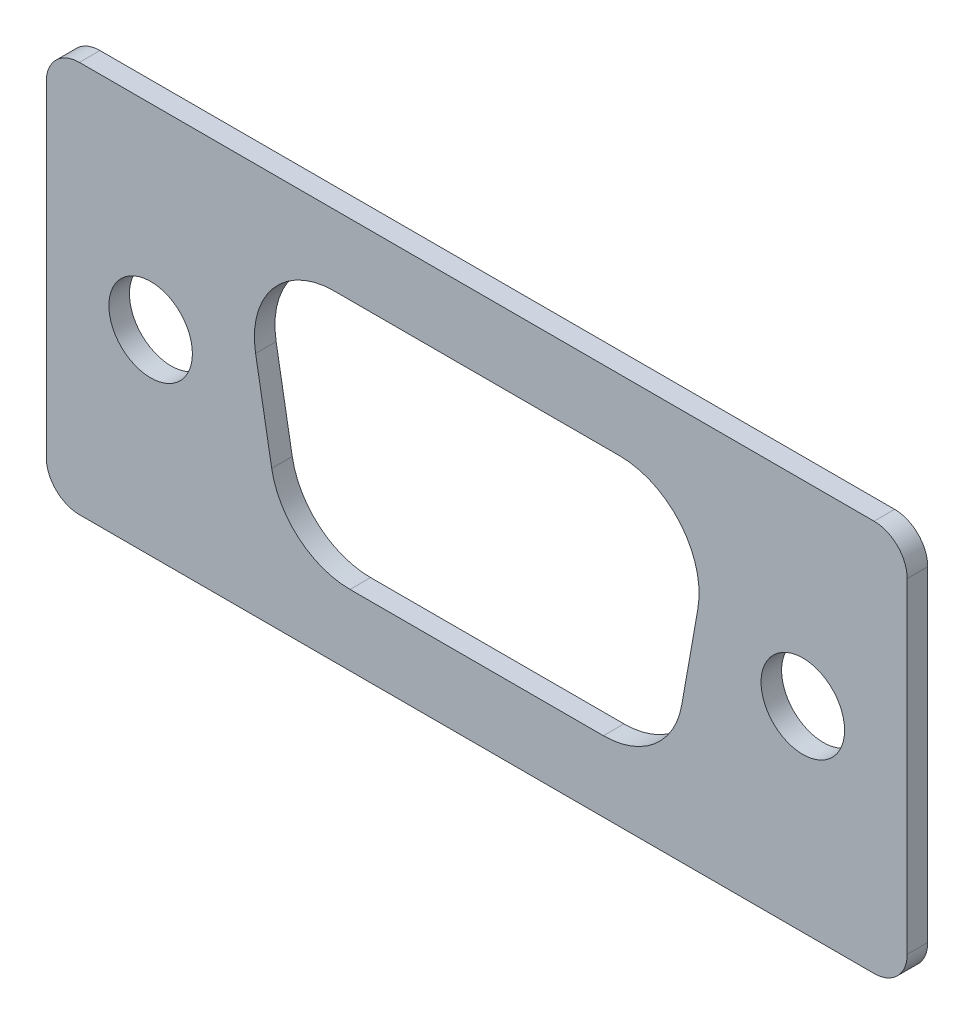
ISO-10303-21;
HEADER;
FILE_DESCRIPTION(('STEP AP214'),'2;1');
FILE_NAME('part.step','',(''),(''),'','','');
FILE_SCHEMA(('AUTOMOTIVE_DESIGN { 1 0 10303 214 1 1 1 1 }'));
ENDSEC;
DATA;
#1=APPLICATION_CONTEXT('core data for automotive mechanical design processes');
#2=APPLICATION_PROTOCOL_DEFINITION('international standard','automotive_design',2000,#1);
#3=PRODUCT_CONTEXT('',#1,'mechanical');
#4=PRODUCT('Part','Part','',(#3));
#5=PRODUCT_RELATED_PRODUCT_CATEGORY('part','',(#4));
#6=PRODUCT_DEFINITION_FORMATION('','',#4);
#7=PRODUCT_DEFINITION_CONTEXT('part definition',#1,'design');
#8=PRODUCT_DEFINITION('design','',#6,#7);
#9=PRODUCT_DEFINITION_SHAPE('','',#8);
#10=(LENGTH_UNIT() NAMED_UNIT(*) SI_UNIT(.MILLI.,.METRE.));
#11=(NAMED_UNIT(*) PLANE_ANGLE_UNIT() SI_UNIT($,.RADIAN.));
#12=(NAMED_UNIT(*) SI_UNIT($,.STERADIAN.) SOLID_ANGLE_UNIT());
#13=UNCERTAINTY_MEASURE_WITH_UNIT(LENGTH_MEASURE(1.E-05),#10,'distance_accuracy_value','');
#14=(GEOMETRIC_REPRESENTATION_CONTEXT(3) GLOBAL_UNCERTAINTY_ASSIGNED_CONTEXT((#13)) GLOBAL_UNIT_ASSIGNED_CONTEXT((#10,
#11,#12)) REPRESENTATION_CONTEXT('',''));
#15=CARTESIAN_POINT('',(0.,0.,0.));
#16=DIRECTION('',(0.,0.,1.));
#17=DIRECTION('',(1.,0.,0.));
#18=AXIS2_PLACEMENT_3D('',#15,#16,#17);
#19=CARTESIAN_POINT('',(31.72,13.74,0.7874));
#20=DIRECTION('',(0.,0.,-1.));
#21=DIRECTION('',(-1.,0.,0.));
#22=AXIS2_PLACEMENT_3D('',#19,#20,#21);
#23=PLANE('',#22);
#24=CARTESIAN_POINT('',(28.99,7.505,0.7874));
#25=DIRECTION('',(0.,0.,1.));
#26=DIRECTION('',(1.,0.,0.));
#27=AXIS2_PLACEMENT_3D('',#24,#25,#26);
#28=CIRCLE('',#27,1.6002);
#29=CARTESIAN_POINT('',(30.5902,7.505,0.7874));
#30=VERTEX_POINT('',#29);
#31=EDGE_CURVE('E219',#30,#30,#28,.T.);
#32=ORIENTED_EDGE('',*,*,#31,.F.);
#33=EDGE_LOOP('',(#32));
#34=FACE_BOUND('',#33,.T.);
#35=CARTESIAN_POINT('',(4.,7.505,0.7874));
#36=DIRECTION('',(0.,0.,1.));
#37=DIRECTION('',(1.,0.,0.));
#38=AXIS2_PLACEMENT_3D('',#35,#36,#37);
#39=CIRCLE('',#38,1.6002);
#40=CARTESIAN_POINT('',(5.6002,7.505,0.7874));
#41=VERTEX_POINT('',#40);
#42=EDGE_CURVE('E225',#41,#41,#39,.T.);
#43=ORIENTED_EDGE('',*,*,#42,.F.);
#44=EDGE_LOOP('',(#43));
#45=FACE_BOUND('',#44,.T.);
#46=CARTESIAN_POINT('',(31.72,13.74,0.7874));
#47=DIRECTION('',(0.,0.,1.));
#48=DIRECTION('',(-1.,0.,0.));
#49=AXIS2_PLACEMENT_3D('',#46,#47,#48);
#50=CIRCLE('',#49,1.27);
#51=CARTESIAN_POINT('',(32.99,13.74,0.7874));
#52=VERTEX_POINT('',#51);
#53=CARTESIAN_POINT('',(31.72,15.01,0.7874));
#54=VERTEX_POINT('',#53);
#55=EDGE_CURVE('E231',#52,#54,#50,.T.);
#56=ORIENTED_EDGE('',*,*,#55,.T.);
#57=DIRECTION('',(-1.,0.,0.));
#58=VECTOR('',#57,1.);
#59=CARTESIAN_POINT('',(1.27000000000001,15.01,0.7874));
#60=LINE('',#59,#58);
#61=CARTESIAN_POINT('',(1.27000000000001,15.01,0.7874));
#62=VERTEX_POINT('',#61);
#63=EDGE_CURVE('E234',#54,#62,#60,.T.);
#64=ORIENTED_EDGE('',*,*,#63,.T.);
#65=CARTESIAN_POINT('',(1.27,13.74,0.7874));
#66=DIRECTION('',(0.,0.,1.));
#67=DIRECTION('',(-1.,0.,0.));
#68=AXIS2_PLACEMENT_3D('',#65,#66,#67);
#69=CIRCLE('',#68,1.27);
#70=CARTESIAN_POINT('',(0.,13.74,0.7874));
#71=VERTEX_POINT('',#70);
#72=EDGE_CURVE('E237',#62,#71,#69,.T.);
#73=ORIENTED_EDGE('',*,*,#72,.T.);
#74=DIRECTION('',(0.,-1.,0.));
#75=VECTOR('',#74,1.);
#76=CARTESIAN_POINT('',(0.,1.27000000000001,0.7874));
#77=LINE('',#76,#75);
#78=CARTESIAN_POINT('',(0.,1.27000000000001,0.7874));
#79=VERTEX_POINT('',#78);
#80=EDGE_CURVE('E239',#71,#79,#77,.T.);
#81=ORIENTED_EDGE('',*,*,#80,.T.);
#82=CARTESIAN_POINT('',(1.27,1.27,0.7874));
#83=DIRECTION('',(0.,0.,1.));
#84=DIRECTION('',(-1.,0.,0.));
#85=AXIS2_PLACEMENT_3D('',#82,#83,#84);
#86=CIRCLE('',#85,1.27);
#87=CARTESIAN_POINT('',(1.27000000000001,0.,0.7874));
#88=VERTEX_POINT('',#87);
#89=EDGE_CURVE('E241',#79,#88,#86,.T.);
#90=ORIENTED_EDGE('',*,*,#89,.T.);
#91=DIRECTION('',(1.,0.,0.));
#92=VECTOR('',#91,1.);
#93=CARTESIAN_POINT('',(1.27000000000001,0.,0.7874));
#94=LINE('',#93,#92);
#95=CARTESIAN_POINT('',(31.72,0.,0.7874));
#96=VERTEX_POINT('',#95);
#97=EDGE_CURVE('E243',#88,#96,#94,.T.);
#98=ORIENTED_EDGE('',*,*,#97,.T.);
#99=CARTESIAN_POINT('',(31.72,1.27,0.7874));
#100=DIRECTION('',(0.,0.,1.));
#101=DIRECTION('',(1.,0.,0.));
#102=AXIS2_PLACEMENT_3D('',#99,#100,#101);
#103=CIRCLE('',#102,1.27);
#104=CARTESIAN_POINT('',(32.99,1.27,0.7874));
#105=VERTEX_POINT('',#104);
#106=EDGE_CURVE('E245',#96,#105,#103,.T.);
#107=ORIENTED_EDGE('',*,*,#106,.T.);
#108=DIRECTION('',(0.,1.,0.));
#109=VECTOR('',#108,1.);
#110=CARTESIAN_POINT('',(32.99,1.27000000000001,0.7874));
#111=LINE('',#110,#109);
#112=EDGE_CURVE('E247',#105,#52,#111,.T.);
#113=ORIENTED_EDGE('',*,*,#112,.T.);
#114=EDGE_LOOP('',(#56,#64,#73,#81,#90,#98,#107,#113));
#115=FACE_BOUND('',#114,.T.);
#116=CARTESIAN_POINT('',(11.6403146906296,5.753,0.7874));
#117=DIRECTION('',(0.,0.,1.));
#118=DIRECTION('',(-1.,0.,0.));
#119=AXIS2_PLACEMENT_3D('',#116,#117,#118);
#120=CIRCLE('',#119,3.048);
#121=CARTESIAN_POINT('',(8.63862065944835,5.22372035447122,0.7874));
#122=VERTEX_POINT('',#121);
#123=CARTESIAN_POINT('',(11.6403146906296,2.705,0.7874));
#124=VERTEX_POINT('',#123);
#125=EDGE_CURVE('E154',#122,#124,#120,.T.);
#126=ORIENTED_EDGE('',*,*,#125,.F.);
#127=DIRECTION('',(0.173648177666924,-0.984807753012209,0.));
#128=VECTOR('',#127,1.);
#129=CARTESIAN_POINT('',(8.63862065944835,5.22372035447122,0.7874));
#130=LINE('',#129,#128);
#131=CARTESIAN_POINT('',(8.02077091904591,8.72772035447122,0.7874));
#132=VERTEX_POINT('',#131);
#133=EDGE_CURVE('E187',#132,#122,#130,.T.);
#134=ORIENTED_EDGE('',*,*,#133,.F.);
#135=CARTESIAN_POINT('',(11.0224649502271,9.257,0.7874));
#136=DIRECTION('',(0.,0.,1.));
#137=DIRECTION('',(1.,0.,0.));
#138=AXIS2_PLACEMENT_3D('',#135,#136,#137);
#139=CIRCLE('',#138,3.048);
#140=CARTESIAN_POINT('',(11.0224649502271,12.305,0.7874));
#141=VERTEX_POINT('',#140);
#142=EDGE_CURVE('E185',#141,#132,#139,.T.);
#143=ORIENTED_EDGE('',*,*,#142,.F.);
#144=DIRECTION('',(-1.,0.,0.));
#145=VECTOR('',#144,1.);
#146=CARTESIAN_POINT('',(11.0224649502271,12.305,0.7874));
#147=LINE('',#146,#145);
#148=CARTESIAN_POINT('',(21.9675350497729,12.305,0.7874));
#149=VERTEX_POINT('',#148);
#150=EDGE_CURVE('E183',#149,#141,#147,.T.);
#151=ORIENTED_EDGE('',*,*,#150,.F.);
#152=CARTESIAN_POINT('',(21.9675350497729,9.257,0.7874));
#153=DIRECTION('',(0.,0.,1.));
#154=DIRECTION('',(-1.,0.,0.));
#155=AXIS2_PLACEMENT_3D('',#152,#153,#154);
#156=CIRCLE('',#155,3.048);
#157=CARTESIAN_POINT('',(24.9692290809541,8.72772035447122,0.7874));
#158=VERTEX_POINT('',#157);
#159=EDGE_CURVE('E181',#158,#149,#156,.T.);
#160=ORIENTED_EDGE('',*,*,#159,.F.);
#161=DIRECTION('',(0.173648177666923,0.984807753012209,0.));
#162=VECTOR('',#161,1.);
#163=CARTESIAN_POINT('',(24.9692290809541,8.72772035447122,0.7874));
#164=LINE('',#163,#162);
#165=CARTESIAN_POINT('',(24.3513793405517,5.22372035447122,0.7874));
#166=VERTEX_POINT('',#165);
#167=EDGE_CURVE('E177',#166,#158,#164,.T.);
#168=ORIENTED_EDGE('',*,*,#167,.F.);
#169=CARTESIAN_POINT('',(21.3496853093704,5.753,0.7874));
#170=DIRECTION('',(0.,0.,1.));
#171=DIRECTION('',(-1.,0.,0.));
#172=AXIS2_PLACEMENT_3D('',#169,#170,#171);
#173=CIRCLE('',#172,3.048);
#174=CARTESIAN_POINT('',(21.3496853093704,2.705,0.7874));
#175=VERTEX_POINT('',#174);
#176=EDGE_CURVE('E175',#175,#166,#173,.T.);
#177=ORIENTED_EDGE('',*,*,#176,.F.);
#178=DIRECTION('',(1.,0.,0.));
#179=VECTOR('',#178,1.);
#180=CARTESIAN_POINT('',(21.3496853093704,2.705,0.7874));
#181=LINE('',#180,#179);
#182=EDGE_CURVE('E162',#124,#175,#181,.T.);
#183=ORIENTED_EDGE('',*,*,#182,.F.);
#184=EDGE_LOOP('',(#126,#134,#143,#151,#160,#168,#177,#183));
#185=FACE_BOUND('',#184,.T.);
#186=ADVANCED_FACE('F41',(#34,#45,#115,#185),#23,.F.);
#187=CARTESIAN_POINT('',(31.72,13.74,0.));
#188=DIRECTION('',(0.,0.,-1.));
#189=DIRECTION('',(-1.,0.,0.));
#190=AXIS2_PLACEMENT_3D('',#187,#188,#189);
#191=PLANE('',#190);
#192=CARTESIAN_POINT('',(4.,7.505,0.));
#193=DIRECTION('',(0.,0.,1.));
#194=DIRECTION('',(1.,0.,0.));
#195=AXIS2_PLACEMENT_3D('',#192,#193,#194);
#196=CIRCLE('',#195,1.6002);
#197=CARTESIAN_POINT('',(5.6002,7.505,0.));
#198=VERTEX_POINT('',#197);
#199=EDGE_CURVE('E222',#198,#198,#196,.T.);
#200=ORIENTED_EDGE('',*,*,#199,.T.);
#201=EDGE_LOOP('',(#200));
#202=FACE_BOUND('',#201,.T.);
#203=CARTESIAN_POINT('',(31.72,13.74,0.));
#204=DIRECTION('',(0.,0.,1.));
#205=DIRECTION('',(-1.,0.,0.));
#206=AXIS2_PLACEMENT_3D('',#203,#204,#205);
#207=CIRCLE('',#206,1.27);
#208=CARTESIAN_POINT('',(32.99,13.74,0.));
#209=VERTEX_POINT('',#208);
#210=CARTESIAN_POINT('',(31.72,15.01,0.));
#211=VERTEX_POINT('',#210);
#212=EDGE_CURVE('E228',#209,#211,#207,.T.);
#213=ORIENTED_EDGE('',*,*,#212,.F.);
#214=DIRECTION('',(0.,1.,0.));
#215=VECTOR('',#214,1.);
#216=CARTESIAN_POINT('',(32.99,1.27000000000001,0.));
#217=LINE('',#216,#215);
#218=CARTESIAN_POINT('',(32.99,1.27,0.));
#219=VERTEX_POINT('',#218);
#220=EDGE_CURVE('E235',#219,#209,#217,.T.);
#221=ORIENTED_EDGE('',*,*,#220,.F.);
#222=CARTESIAN_POINT('',(31.72,1.27,0.));
#223=DIRECTION('',(0.,0.,1.));
#224=DIRECTION('',(1.,0.,0.));
#225=AXIS2_PLACEMENT_3D('',#222,#223,#224);
#226=CIRCLE('',#225,1.27);
#227=CARTESIAN_POINT('',(31.72,0.,0.));
#228=VERTEX_POINT('',#227);
#229=EDGE_CURVE('E262',#228,#219,#226,.T.);
#230=ORIENTED_EDGE('',*,*,#229,.F.);
#231=DIRECTION('',(1.,0.,0.));
#232=VECTOR('',#231,1.);
#233=CARTESIAN_POINT('',(1.27000000000001,0.,0.));
#234=LINE('',#233,#232);
#235=CARTESIAN_POINT('',(1.27000000000001,0.,0.));
#236=VERTEX_POINT('',#235);
#237=EDGE_CURVE('E260',#236,#228,#234,.T.);
#238=ORIENTED_EDGE('',*,*,#237,.F.);
#239=CARTESIAN_POINT('',(1.27,1.27,0.));
#240=DIRECTION('',(0.,0.,1.));
#241=DIRECTION('',(-1.,0.,0.));
#242=AXIS2_PLACEMENT_3D('',#239,#240,#241);
#243=CIRCLE('',#242,1.27);
#244=CARTESIAN_POINT('',(0.,1.27000000000001,0.));
#245=VERTEX_POINT('',#244);
#246=EDGE_CURVE('E258',#245,#236,#243,.T.);
#247=ORIENTED_EDGE('',*,*,#246,.F.);
#248=DIRECTION('',(0.,-1.,0.));
#249=VECTOR('',#248,1.);
#250=CARTESIAN_POINT('',(0.,1.27000000000001,0.));
#251=LINE('',#250,#249);
#252=CARTESIAN_POINT('',(0.,13.74,0.));
#253=VERTEX_POINT('',#252);
#254=EDGE_CURVE('E256',#253,#245,#251,.T.);
#255=ORIENTED_EDGE('',*,*,#254,.F.);
#256=CARTESIAN_POINT('',(1.27,13.74,0.));
#257=DIRECTION('',(0.,0.,1.));
#258=DIRECTION('',(-1.,0.,0.));
#259=AXIS2_PLACEMENT_3D('',#256,#257,#258);
#260=CIRCLE('',#259,1.27);
#261=CARTESIAN_POINT('',(1.27000000000001,15.01,0.));
#262=VERTEX_POINT('',#261);
#263=EDGE_CURVE('E254',#262,#253,#260,.T.);
#264=ORIENTED_EDGE('',*,*,#263,.F.);
#265=DIRECTION('',(-1.,0.,0.));
#266=VECTOR('',#265,1.);
#267=CARTESIAN_POINT('',(1.27000000000001,15.01,0.));
#268=LINE('',#267,#266);
#269=EDGE_CURVE('E252',#211,#262,#268,.T.);
#270=ORIENTED_EDGE('',*,*,#269,.F.);
#271=EDGE_LOOP('',(#213,#221,#230,#238,#247,#255,#264,#270));
#272=FACE_BOUND('',#271,.T.);
#273=CARTESIAN_POINT('',(28.99,7.505,0.));
#274=DIRECTION('',(0.,0.,1.));
#275=DIRECTION('',(1.,0.,0.));
#276=AXIS2_PLACEMENT_3D('',#273,#274,#275);
#277=CIRCLE('',#276,1.6002);
#278=CARTESIAN_POINT('',(30.5902,7.505,0.));
#279=VERTEX_POINT('',#278);
#280=EDGE_CURVE('E170',#279,#279,#277,.T.);
#281=ORIENTED_EDGE('',*,*,#280,.T.);
#282=EDGE_LOOP('',(#281));
#283=FACE_BOUND('',#282,.T.);
#284=DIRECTION('',(0.173648177666924,-0.984807753012209,0.));
#285=VECTOR('',#284,1.);
#286=CARTESIAN_POINT('',(8.63862065944835,5.22372035447122,0.));
#287=LINE('',#286,#285);
#288=CARTESIAN_POINT('',(8.02077091904591,8.72772035447122,0.));
#289=VERTEX_POINT('',#288);
#290=CARTESIAN_POINT('',(8.63862065944835,5.22372035447122,0.));
#291=VERTEX_POINT('',#290);
#292=EDGE_CURVE('E163',#289,#291,#287,.T.);
#293=ORIENTED_EDGE('',*,*,#292,.T.);
#294=CARTESIAN_POINT('',(11.6403146906296,5.753,0.));
#295=DIRECTION('',(0.,0.,1.));
#296=DIRECTION('',(-1.,0.,0.));
#297=AXIS2_PLACEMENT_3D('',#294,#295,#296);
#298=CIRCLE('',#297,3.048);
#299=CARTESIAN_POINT('',(11.6403146906296,2.705,0.));
#300=VERTEX_POINT('',#299);
#301=EDGE_CURVE('E64',#291,#300,#298,.T.);
#302=ORIENTED_EDGE('',*,*,#301,.T.);
#303=DIRECTION('',(1.,0.,0.));
#304=VECTOR('',#303,1.);
#305=CARTESIAN_POINT('',(21.3496853093704,2.705,0.));
#306=LINE('',#305,#304);
#307=CARTESIAN_POINT('',(21.3496853093704,2.705,0.));
#308=VERTEX_POINT('',#307);
#309=EDGE_CURVE('E169',#300,#308,#306,.T.);
#310=ORIENTED_EDGE('',*,*,#309,.T.);
#311=CARTESIAN_POINT('',(21.3496853093704,5.753,0.));
#312=DIRECTION('',(0.,0.,1.));
#313=DIRECTION('',(-1.,0.,0.));
#314=AXIS2_PLACEMENT_3D('',#311,#312,#313);
#315=CIRCLE('',#314,3.048);
#316=CARTESIAN_POINT('',(24.3513793405517,5.22372035447122,0.));
#317=VERTEX_POINT('',#316);
#318=EDGE_CURVE('E191',#308,#317,#315,.T.);
#319=ORIENTED_EDGE('',*,*,#318,.T.);
#320=DIRECTION('',(0.173648177666923,0.984807753012209,0.));
#321=VECTOR('',#320,1.);
#322=CARTESIAN_POINT('',(24.9692290809541,8.72772035447122,0.));
#323=LINE('',#322,#321);
#324=CARTESIAN_POINT('',(24.9692290809541,8.72772035447122,0.));
#325=VERTEX_POINT('',#324);
#326=EDGE_CURVE('E194',#317,#325,#323,.T.);
#327=ORIENTED_EDGE('',*,*,#326,.T.);
#328=CARTESIAN_POINT('',(21.9675350497729,9.257,0.));
#329=DIRECTION('',(0.,0.,1.));
#330=DIRECTION('',(-1.,0.,0.));
#331=AXIS2_PLACEMENT_3D('',#328,#329,#330);
#332=CIRCLE('',#331,3.048);
#333=CARTESIAN_POINT('',(21.9675350497729,12.305,0.));
#334=VERTEX_POINT('',#333);
#335=EDGE_CURVE('E197',#325,#334,#332,.T.);
#336=ORIENTED_EDGE('',*,*,#335,.T.);
#337=DIRECTION('',(-1.,0.,0.));
#338=VECTOR('',#337,1.);
#339=CARTESIAN_POINT('',(11.0224649502271,12.305,0.));
#340=LINE('',#339,#338);
#341=CARTESIAN_POINT('',(11.0224649502271,12.305,0.));
#342=VERTEX_POINT('',#341);
#343=EDGE_CURVE('E200',#334,#342,#340,.T.);
#344=ORIENTED_EDGE('',*,*,#343,.T.);
#345=CARTESIAN_POINT('',(11.0224649502271,9.257,0.));
#346=DIRECTION('',(0.,0.,1.));
#347=DIRECTION('',(1.,0.,0.));
#348=AXIS2_PLACEMENT_3D('',#345,#346,#347);
#349=CIRCLE('',#348,3.048);
#350=EDGE_CURVE('E203',#342,#289,#349,.T.);
#351=ORIENTED_EDGE('',*,*,#350,.T.);
#352=EDGE_LOOP('',(#293,#302,#310,#319,#327,#336,#344,#351));
#353=FACE_BOUND('',#352,.T.);
#354=ADVANCED_FACE('F292',(#202,#272,#283,#353),#191,.T.);
#355=CARTESIAN_POINT('',(31.72,13.74,0.7874));
#356=DIRECTION('',(0.,0.,-1.));
#357=DIRECTION('',(-1.,0.,0.));
#358=AXIS2_PLACEMENT_3D('',#355,#356,#357);
#359=CYLINDRICAL_SURFACE('',#358,1.27);
#360=ORIENTED_EDGE('',*,*,#212,.T.);
#361=DIRECTION('',(0.,0.,-1.));
#362=VECTOR('',#361,1.);
#363=CARTESIAN_POINT('',(31.72,15.01,0.7874));
#364=LINE('',#363,#362);
#365=EDGE_CURVE('E13',#54,#211,#364,.T.);
#366=ORIENTED_EDGE('',*,*,#365,.F.);
#367=ORIENTED_EDGE('',*,*,#55,.F.);
#368=DIRECTION('',(0.,0.,-1.));
#369=VECTOR('',#368,1.);
#370=CARTESIAN_POINT('',(32.99,13.74,0.7874));
#371=LINE('',#370,#369);
#372=EDGE_CURVE('E249',#52,#209,#371,.T.);
#373=ORIENTED_EDGE('',*,*,#372,.T.);
#374=EDGE_LOOP('',(#360,#366,#367,#373));
#375=FACE_BOUND('',#374,.T.);
#376=ADVANCED_FACE('F43',(#375),#359,.T.);
#377=CARTESIAN_POINT('',(1.27000000000001,15.01,0.7874));
#378=DIRECTION('',(0.,-1.,0.));
#379=DIRECTION('',(0.,0.,-1.));
#380=AXIS2_PLACEMENT_3D('',#377,#378,#379);
#381=PLANE('',#380);
#382=ORIENTED_EDGE('',*,*,#269,.T.);
#383=DIRECTION('',(0.,0.,-1.));
#384=VECTOR('',#383,1.);
#385=CARTESIAN_POINT('',(1.27000000000001,15.01,0.7874));
#386=LINE('',#385,#384);
#387=EDGE_CURVE('E49',#62,#262,#386,.T.);
#388=ORIENTED_EDGE('',*,*,#387,.F.);
#389=ORIENTED_EDGE('',*,*,#63,.F.);
#390=ORIENTED_EDGE('',*,*,#365,.T.);
#391=EDGE_LOOP('',(#382,#388,#389,#390));
#392=FACE_BOUND('',#391,.T.);
#393=ADVANCED_FACE('F309',(#392),#381,.F.);
#394=CARTESIAN_POINT('',(1.27,13.74,0.7874));
#395=DIRECTION('',(0.,0.,-1.));
#396=DIRECTION('',(-1.,0.,0.));
#397=AXIS2_PLACEMENT_3D('',#394,#395,#396);
#398=CYLINDRICAL_SURFACE('',#397,1.27);
#399=ORIENTED_EDGE('',*,*,#263,.T.);
#400=DIRECTION('',(0.,0.,-1.));
#401=VECTOR('',#400,1.);
#402=CARTESIAN_POINT('',(0.,13.74,0.7874));
#403=LINE('',#402,#401);
#404=EDGE_CURVE('E279',#71,#253,#403,.T.);
#405=ORIENTED_EDGE('',*,*,#404,.F.);
#406=ORIENTED_EDGE('',*,*,#72,.F.);
#407=ORIENTED_EDGE('',*,*,#387,.T.);
#408=EDGE_LOOP('',(#399,#405,#406,#407));
#409=FACE_BOUND('',#408,.T.);
#410=ADVANCED_FACE('F286',(#409),#398,.T.);
#411=CARTESIAN_POINT('',(0.,1.27000000000001,0.7874));
#412=DIRECTION('',(1.,0.,0.));
#413=DIRECTION('',(0.,0.,-1.));
#414=AXIS2_PLACEMENT_3D('',#411,#412,#413);
#415=PLANE('',#414);
#416=ORIENTED_EDGE('',*,*,#254,.T.);
#417=DIRECTION('',(0.,0.,-1.));
#418=VECTOR('',#417,1.);
#419=CARTESIAN_POINT('',(0.,1.27000000000001,0.7874));
#420=LINE('',#419,#418);
#421=EDGE_CURVE('E276',#79,#245,#420,.T.);
#422=ORIENTED_EDGE('',*,*,#421,.F.);
#423=ORIENTED_EDGE('',*,*,#80,.F.);
#424=ORIENTED_EDGE('',*,*,#404,.T.);
#425=EDGE_LOOP('',(#416,#422,#423,#424));
#426=FACE_BOUND('',#425,.T.);
#427=ADVANCED_FACE('F298',(#426),#415,.F.);
#428=CARTESIAN_POINT('',(1.27,1.27,0.7874));
#429=DIRECTION('',(0.,0.,-1.));
#430=DIRECTION('',(-1.,0.,0.));
#431=AXIS2_PLACEMENT_3D('',#428,#429,#430);
#432=CYLINDRICAL_SURFACE('',#431,1.27);
#433=ORIENTED_EDGE('',*,*,#246,.T.);
#434=DIRECTION('',(0.,0.,-1.));
#435=VECTOR('',#434,1.);
#436=CARTESIAN_POINT('',(1.27000000000001,0.,0.7874));
#437=LINE('',#436,#435);
#438=EDGE_CURVE('E273',#88,#236,#437,.T.);
#439=ORIENTED_EDGE('',*,*,#438,.F.);
#440=ORIENTED_EDGE('',*,*,#89,.F.);
#441=ORIENTED_EDGE('',*,*,#421,.T.);
#442=EDGE_LOOP('',(#433,#439,#440,#441));
#443=FACE_BOUND('',#442,.T.);
#444=ADVANCED_FACE('F302',(#443),#432,.T.);
#445=CARTESIAN_POINT('',(1.27000000000001,0.,0.7874));
#446=DIRECTION('',(0.,1.,0.));
#447=DIRECTION('',(0.,0.,1.));
#448=AXIS2_PLACEMENT_3D('',#445,#446,#447);
#449=PLANE('',#448);
#450=ORIENTED_EDGE('',*,*,#237,.T.);
#451=DIRECTION('',(0.,0.,-1.));
#452=VECTOR('',#451,1.);
#453=CARTESIAN_POINT('',(31.72,0.,0.7874));
#454=LINE('',#453,#452);
#455=EDGE_CURVE('E270',#96,#228,#454,.T.);
#456=ORIENTED_EDGE('',*,*,#455,.F.);
#457=ORIENTED_EDGE('',*,*,#97,.F.);
#458=ORIENTED_EDGE('',*,*,#438,.T.);
#459=EDGE_LOOP('',(#450,#456,#457,#458));
#460=FACE_BOUND('',#459,.T.);
#461=ADVANCED_FACE('F322',(#460),#449,.F.);
#462=CARTESIAN_POINT('',(31.72,1.27,0.7874));
#463=DIRECTION('',(0.,0.,-1.));
#464=DIRECTION('',(-1.,0.,0.));
#465=AXIS2_PLACEMENT_3D('',#462,#463,#464);
#466=CYLINDRICAL_SURFACE('',#465,1.27);
#467=ORIENTED_EDGE('',*,*,#229,.T.);
#468=DIRECTION('',(0.,0.,-1.));
#469=VECTOR('',#468,1.);
#470=CARTESIAN_POINT('',(32.99,1.27,0.7874));
#471=LINE('',#470,#469);
#472=EDGE_CURVE('E267',#105,#219,#471,.T.);
#473=ORIENTED_EDGE('',*,*,#472,.F.);
#474=ORIENTED_EDGE('',*,*,#106,.F.);
#475=ORIENTED_EDGE('',*,*,#455,.T.);
#476=EDGE_LOOP('',(#467,#473,#474,#475));
#477=FACE_BOUND('',#476,.T.);
#478=ADVANCED_FACE('F320',(#477),#466,.T.);
#479=CARTESIAN_POINT('',(32.99,1.27000000000001,0.7874));
#480=DIRECTION('',(-1.,0.,0.));
#481=DIRECTION('',(0.,0.,1.));
#482=AXIS2_PLACEMENT_3D('',#479,#480,#481);
#483=PLANE('',#482);
#484=ORIENTED_EDGE('',*,*,#220,.T.);
#485=ORIENTED_EDGE('',*,*,#372,.F.);
#486=ORIENTED_EDGE('',*,*,#112,.F.);
#487=ORIENTED_EDGE('',*,*,#472,.T.);
#488=EDGE_LOOP('',(#484,#485,#486,#487));
#489=FACE_BOUND('',#488,.T.);
#490=ADVANCED_FACE('F315',(#489),#483,.F.);
#491=CARTESIAN_POINT('',(4.,7.505,0.7874));
#492=DIRECTION('',(0.,0.,-1.));
#493=DIRECTION('',(-1.,0.,0.));
#494=AXIS2_PLACEMENT_3D('',#491,#492,#493);
#495=CYLINDRICAL_SURFACE('',#494,1.6002);
#496=ORIENTED_EDGE('',*,*,#42,.T.);
#497=EDGE_LOOP('',(#496));
#498=FACE_BOUND('',#497,.T.);
#499=ORIENTED_EDGE('',*,*,#199,.F.);
#500=EDGE_LOOP('',(#499));
#501=FACE_BOUND('',#500,.T.);
#502=ADVANCED_FACE('F342',(#498,#501),#495,.F.);
#503=CARTESIAN_POINT('',(28.99,7.505,0.7874));
#504=DIRECTION('',(0.,0.,-1.));
#505=DIRECTION('',(-1.,0.,0.));
#506=AXIS2_PLACEMENT_3D('',#503,#504,#505);
#507=CYLINDRICAL_SURFACE('',#506,1.6002);
#508=ORIENTED_EDGE('',*,*,#31,.T.);
#509=EDGE_LOOP('',(#508));
#510=FACE_BOUND('',#509,.T.);
#511=ORIENTED_EDGE('',*,*,#280,.F.);
#512=EDGE_LOOP('',(#511));
#513=FACE_BOUND('',#512,.T.);
#514=ADVANCED_FACE('F349',(#510,#513),#507,.F.);
#515=CARTESIAN_POINT('',(11.6403146906296,5.753,0.7874));
#516=DIRECTION('',(0.,0.,-1.));
#517=DIRECTION('',(-1.,0.,0.));
#518=AXIS2_PLACEMENT_3D('',#515,#516,#517);
#519=CYLINDRICAL_SURFACE('',#518,3.048);
#520=ORIENTED_EDGE('',*,*,#301,.F.);
#521=DIRECTION('',(0.,0.,-1.));
#522=VECTOR('',#521,1.);
#523=CARTESIAN_POINT('',(8.63862065944835,5.22372035447122,0.7874));
#524=LINE('',#523,#522);
#525=EDGE_CURVE('E158',#122,#291,#524,.T.);
#526=ORIENTED_EDGE('',*,*,#525,.F.);
#527=ORIENTED_EDGE('',*,*,#125,.T.);
#528=DIRECTION('',(0.,0.,-1.));
#529=VECTOR('',#528,1.);
#530=CARTESIAN_POINT('',(11.6403146906296,2.705,0.7874));
#531=LINE('',#530,#529);
#532=EDGE_CURVE('E157',#124,#300,#531,.T.);
#533=ORIENTED_EDGE('',*,*,#532,.T.);
#534=EDGE_LOOP('',(#520,#526,#527,#533));
#535=FACE_BOUND('',#534,.T.);
#536=ADVANCED_FACE('F156',(#535),#519,.F.);
#537=CARTESIAN_POINT('',(21.3496853093704,2.705,0.7874));
#538=DIRECTION('',(0.,1.,0.));
#539=DIRECTION('',(-1.,0.,0.));
#540=AXIS2_PLACEMENT_3D('',#537,#538,#539);
#541=PLANE('',#540);
#542=ORIENTED_EDGE('',*,*,#309,.F.);
#543=ORIENTED_EDGE('',*,*,#532,.F.);
#544=ORIENTED_EDGE('',*,*,#182,.T.);
#545=DIRECTION('',(0.,0.,-1.));
#546=VECTOR('',#545,1.);
#547=CARTESIAN_POINT('',(21.3496853093704,2.705,0.7874));
#548=LINE('',#547,#546);
#549=EDGE_CURVE('E171',#175,#308,#548,.T.);
#550=ORIENTED_EDGE('',*,*,#549,.T.);
#551=EDGE_LOOP('',(#542,#543,#544,#550));
#552=FACE_BOUND('',#551,.T.);
#553=ADVANCED_FACE('F166',(#552),#541,.T.);
#554=CARTESIAN_POINT('',(21.3496853093704,5.753,0.7874));
#555=DIRECTION('',(0.,0.,-1.));
#556=DIRECTION('',(-1.,0.,0.));
#557=AXIS2_PLACEMENT_3D('',#554,#555,#556);
#558=CYLINDRICAL_SURFACE('',#557,3.048);
#559=ORIENTED_EDGE('',*,*,#318,.F.);
#560=ORIENTED_EDGE('',*,*,#549,.F.);
#561=ORIENTED_EDGE('',*,*,#176,.T.);
#562=DIRECTION('',(0.,0.,-1.));
#563=VECTOR('',#562,1.);
#564=CARTESIAN_POINT('',(24.3513793405517,5.22372035447122,0.7874));
#565=LINE('',#564,#563);
#566=EDGE_CURVE('E216',#166,#317,#565,.T.);
#567=ORIENTED_EDGE('',*,*,#566,.T.);
#568=EDGE_LOOP('',(#559,#560,#561,#567));
#569=FACE_BOUND('',#568,.T.);
#570=ADVANCED_FACE('F366',(#569),#558,.F.);
#571=CARTESIAN_POINT('',(24.9692290809541,8.72772035447122,0.7874));
#572=DIRECTION('',(-0.984807753012209,0.173648177666923,0.));
#573=DIRECTION('',(-0.173648177666923,-0.984807753012209,0.));
#574=AXIS2_PLACEMENT_3D('',#571,#572,#573);
#575=PLANE('',#574);
#576=ORIENTED_EDGE('',*,*,#326,.F.);
#577=ORIENTED_EDGE('',*,*,#566,.F.);
#578=ORIENTED_EDGE('',*,*,#167,.T.);
#579=DIRECTION('',(0.,0.,-1.));
#580=VECTOR('',#579,1.);
#581=CARTESIAN_POINT('',(24.9692290809541,8.72772035447122,0.7874));
#582=LINE('',#581,#580);
#583=EDGE_CURVE('E214',#158,#325,#582,.T.);
#584=ORIENTED_EDGE('',*,*,#583,.T.);
#585=EDGE_LOOP('',(#576,#577,#578,#584));
#586=FACE_BOUND('',#585,.T.);
#587=ADVANCED_FACE('F369',(#586),#575,.T.);
#588=CARTESIAN_POINT('',(21.9675350497729,9.257,0.7874));
#589=DIRECTION('',(0.,0.,-1.));
#590=DIRECTION('',(-1.,0.,0.));
#591=AXIS2_PLACEMENT_3D('',#588,#589,#590);
#592=CYLINDRICAL_SURFACE('',#591,3.048);
#593=ORIENTED_EDGE('',*,*,#335,.F.);
#594=ORIENTED_EDGE('',*,*,#583,.F.);
#595=ORIENTED_EDGE('',*,*,#159,.T.);
#596=DIRECTION('',(0.,0.,-1.));
#597=VECTOR('',#596,1.);
#598=CARTESIAN_POINT('',(21.9675350497729,12.305,0.7874));
#599=LINE('',#598,#597);
#600=EDGE_CURVE('E212',#149,#334,#599,.T.);
#601=ORIENTED_EDGE('',*,*,#600,.T.);
#602=EDGE_LOOP('',(#593,#594,#595,#601));
#603=FACE_BOUND('',#602,.T.);
#604=ADVANCED_FACE('F373',(#603),#592,.F.);
#605=CARTESIAN_POINT('',(11.0224649502271,12.305,0.7874));
#606=DIRECTION('',(0.,-1.,0.));
#607=DIRECTION('',(1.,0.,0.));
#608=AXIS2_PLACEMENT_3D('',#605,#606,#607);
#609=PLANE('',#608);
#610=ORIENTED_EDGE('',*,*,#343,.F.);
#611=ORIENTED_EDGE('',*,*,#600,.F.);
#612=ORIENTED_EDGE('',*,*,#150,.T.);
#613=DIRECTION('',(0.,0.,-1.));
#614=VECTOR('',#613,1.);
#615=CARTESIAN_POINT('',(11.0224649502271,12.305,0.7874));
#616=LINE('',#615,#614);
#617=EDGE_CURVE('E210',#141,#342,#616,.T.);
#618=ORIENTED_EDGE('',*,*,#617,.T.);
#619=EDGE_LOOP('',(#610,#611,#612,#618));
#620=FACE_BOUND('',#619,.T.);
#621=ADVANCED_FACE('F377',(#620),#609,.T.);
#622=CARTESIAN_POINT('',(11.0224649502271,9.257,0.7874));
#623=DIRECTION('',(0.,0.,-1.));
#624=DIRECTION('',(-1.,0.,0.));
#625=AXIS2_PLACEMENT_3D('',#622,#623,#624);
#626=CYLINDRICAL_SURFACE('',#625,3.048);
#627=ORIENTED_EDGE('',*,*,#350,.F.);
#628=ORIENTED_EDGE('',*,*,#617,.F.);
#629=ORIENTED_EDGE('',*,*,#142,.T.);
#630=DIRECTION('',(0.,0.,-1.));
#631=VECTOR('',#630,1.);
#632=CARTESIAN_POINT('',(8.02077091904591,8.72772035447122,0.7874));
#633=LINE('',#632,#631);
#634=EDGE_CURVE('E56',#132,#289,#633,.T.);
#635=ORIENTED_EDGE('',*,*,#634,.T.);
#636=EDGE_LOOP('',(#627,#628,#629,#635));
#637=FACE_BOUND('',#636,.T.);
#638=ADVANCED_FACE('F381',(#637),#626,.F.);
#639=CARTESIAN_POINT('',(8.63862065944835,5.22372035447122,0.7874));
#640=DIRECTION('',(0.984807753012209,0.173648177666924,0.));
#641=DIRECTION('',(-0.173648177666924,0.984807753012209,0.));
#642=AXIS2_PLACEMENT_3D('',#639,#640,#641);
#643=PLANE('',#642);
#644=ORIENTED_EDGE('',*,*,#292,.F.);
#645=ORIENTED_EDGE('',*,*,#634,.F.);
#646=ORIENTED_EDGE('',*,*,#133,.T.);
#647=ORIENTED_EDGE('',*,*,#525,.T.);
#648=EDGE_LOOP('',(#644,#645,#646,#647));
#649=FACE_BOUND('',#648,.T.);
#650=ADVANCED_FACE('F385',(#649),#643,.T.);
#651=CLOSED_SHELL('',(#186,#354,#376,#393,#410,#427,#444,#461,#478,#490,#502,#514,#536,#553,
#570,#587,#604,#621,#638,#650));
#652=MANIFOLD_SOLID_BREP('B2',#651);
#653=ADVANCED_BREP_SHAPE_REPRESENTATION('',(#18,#652),#14);
#654=SHAPE_DEFINITION_REPRESENTATION(#9,#653);
ENDSEC;
END-ISO-10303-21;
